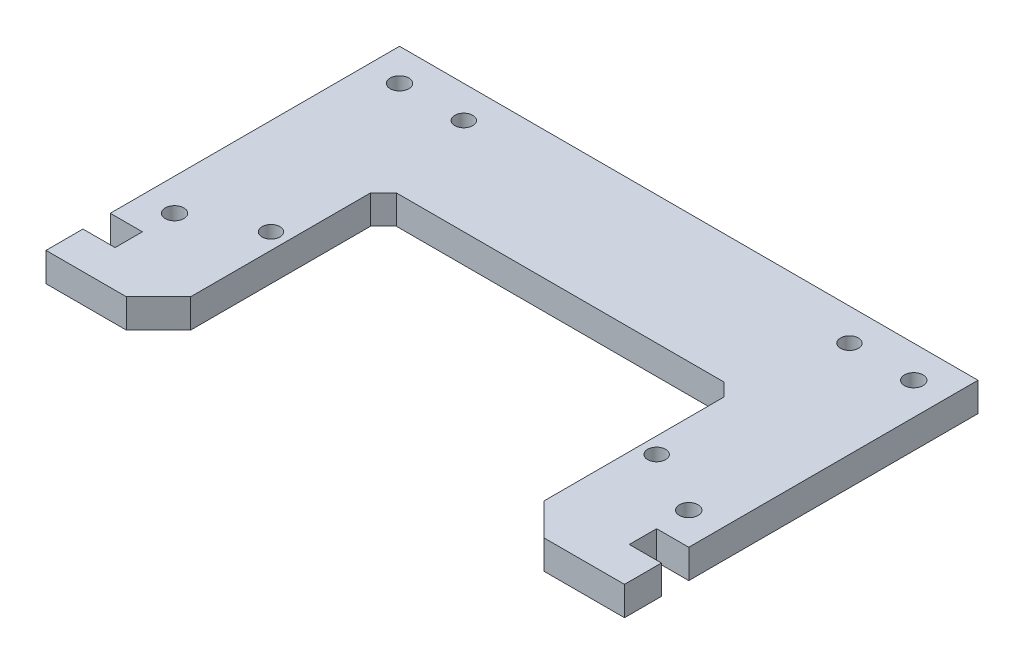
ISO-10303-21;
HEADER;
FILE_DESCRIPTION(('STEP AP214'),'2;1');
FILE_NAME('part.step','',(''),(''),'','','');
FILE_SCHEMA(('AUTOMOTIVE_DESIGN { 1 0 10303 214 1 1 1 1 }'));
ENDSEC;
DATA;
#1=APPLICATION_CONTEXT('core data for automotive mechanical design processes');
#2=APPLICATION_PROTOCOL_DEFINITION('international standard','automotive_design',2000,#1);
#3=PRODUCT_CONTEXT('',#1,'mechanical');
#4=PRODUCT('Part','Part','',(#3));
#5=PRODUCT_RELATED_PRODUCT_CATEGORY('part','',(#4));
#6=PRODUCT_DEFINITION_FORMATION('','',#4);
#7=PRODUCT_DEFINITION_CONTEXT('part definition',#1,'design');
#8=PRODUCT_DEFINITION('design','',#6,#7);
#9=PRODUCT_DEFINITION_SHAPE('','',#8);
#10=(LENGTH_UNIT() NAMED_UNIT(*) SI_UNIT(.MILLI.,.METRE.));
#11=(NAMED_UNIT(*) PLANE_ANGLE_UNIT() SI_UNIT($,.RADIAN.));
#12=(NAMED_UNIT(*) SI_UNIT($,.STERADIAN.) SOLID_ANGLE_UNIT());
#13=UNCERTAINTY_MEASURE_WITH_UNIT(LENGTH_MEASURE(1.E-05),#10,'distance_accuracy_value','');
#14=(GEOMETRIC_REPRESENTATION_CONTEXT(3) GLOBAL_UNCERTAINTY_ASSIGNED_CONTEXT((#13)) GLOBAL_UNIT_ASSIGNED_CONTEXT((#10,
#11,#12)) REPRESENTATION_CONTEXT('',''));
#15=CARTESIAN_POINT('',(0.,0.,0.));
#16=DIRECTION('',(0.,0.,1.));
#17=DIRECTION('',(1.,0.,0.));
#18=AXIS2_PLACEMENT_3D('',#15,#16,#17);
#19=CARTESIAN_POINT('',(-45.,4.5,55.));
#20=DIRECTION('',(0.,1.,0.));
#21=DIRECTION('',(0.,0.,1.));
#22=AXIS2_PLACEMENT_3D('',#19,#20,#21);
#23=PLANE('',#22);
#24=CARTESIAN_POINT('',(30.,4.5,35.));
#25=DIRECTION('',(0.,-1.,0.));
#26=DIRECTION('',(0.,0.,1.));
#27=AXIS2_PLACEMENT_3D('',#24,#25,#26);
#28=CIRCLE('',#27,1.4);
#29=CARTESIAN_POINT('',(30.,4.5,36.4));
#30=VERTEX_POINT('',#29);
#31=EDGE_CURVE('E511',#30,#30,#28,.T.);
#32=ORIENTED_EDGE('',*,*,#31,.T.);
#33=EDGE_LOOP('',(#32));
#34=FACE_BOUND('',#33,.T.);
#35=CARTESIAN_POINT('',(-30.,4.5,5.));
#36=DIRECTION('',(0.,1.,0.));
#37=DIRECTION('',(0.,0.,1.));
#38=AXIS2_PLACEMENT_3D('',#35,#36,#37);
#39=CIRCLE('',#38,1.4);
#40=CARTESIAN_POINT('',(-30.,4.5,6.4));
#41=VERTEX_POINT('',#40);
#42=EDGE_CURVE('E520',#41,#41,#39,.T.);
#43=ORIENTED_EDGE('',*,*,#42,.F.);
#44=EDGE_LOOP('',(#43));
#45=FACE_BOUND('',#44,.T.);
#46=CARTESIAN_POINT('',(-30.,4.5,35.));
#47=DIRECTION('',(0.,1.,0.));
#48=DIRECTION('',(0.,0.,1.));
#49=AXIS2_PLACEMENT_3D('',#46,#47,#48);
#50=CIRCLE('',#49,1.4);
#51=CARTESIAN_POINT('',(-30.,4.5,36.4));
#52=VERTEX_POINT('',#51);
#53=EDGE_CURVE('E198',#52,#52,#50,.T.);
#54=ORIENTED_EDGE('',*,*,#53,.F.);
#55=EDGE_LOOP('',(#54));
#56=FACE_BOUND('',#55,.T.);
#57=DIRECTION('',(0.,0.,-1.));
#58=VECTOR('',#57,1.);
#59=CARTESIAN_POINT('',(27.5,4.5,55.));
#60=LINE('',#59,#58);
#61=CARTESIAN_POINT('',(27.5,4.5,50.));
#62=VERTEX_POINT('',#61);
#63=CARTESIAN_POINT('',(27.5,4.5,22.));
#64=VERTEX_POINT('',#63);
#65=EDGE_CURVE('E231',#62,#64,#60,.T.);
#66=ORIENTED_EDGE('',*,*,#65,.F.);
#67=DIRECTION('',(-0.707106781186549,0.,-0.707106781186546));
#68=VECTOR('',#67,1.);
#69=CARTESIAN_POINT('',(-6.25000000000018,4.5,16.25));
#70=LINE('',#69,#68);
#71=CARTESIAN_POINT('',(32.5,4.5,55.));
#72=VERTEX_POINT('',#71);
#73=EDGE_CURVE('E320',#62,#72,#70,.F.);
#74=ORIENTED_EDGE('',*,*,#73,.T.);
#75=DIRECTION('',(1.,0.,0.));
#76=VECTOR('',#75,1.);
#77=CARTESIAN_POINT('',(-45.,4.5,55.));
#78=LINE('',#77,#76);
#79=CARTESIAN_POINT('',(45.,4.5,55.));
#80=VERTEX_POINT('',#79);
#81=EDGE_CURVE('E279',#72,#80,#78,.T.);
#82=ORIENTED_EDGE('',*,*,#81,.T.);
#83=DIRECTION('',(0.,0.,-1.));
#84=VECTOR('',#83,1.);
#85=CARTESIAN_POINT('',(45.,4.5,0.));
#86=LINE('',#85,#84);
#87=CARTESIAN_POINT('',(45.,4.5,49.25));
#88=VERTEX_POINT('',#87);
#89=EDGE_CURVE('E285',#80,#88,#86,.T.);
#90=ORIENTED_EDGE('',*,*,#89,.T.);
#91=DIRECTION('',(1.,0.,0.));
#92=VECTOR('',#91,1.);
#93=CARTESIAN_POINT('',(45.,4.5,49.25));
#94=LINE('',#93,#92);
#95=CARTESIAN_POINT('',(40.,4.5,49.25));
#96=VERTEX_POINT('',#95);
#97=EDGE_CURVE('E193',#96,#88,#94,.T.);
#98=ORIENTED_EDGE('',*,*,#97,.F.);
#99=DIRECTION('',(0.,0.,1.));
#100=VECTOR('',#99,1.);
#101=CARTESIAN_POINT('',(40.,4.5,45.));
#102=LINE('',#101,#100);
#103=CARTESIAN_POINT('',(40.,4.5,45.));
#104=VERTEX_POINT('',#103);
#105=EDGE_CURVE('E195',#104,#96,#102,.T.);
#106=ORIENTED_EDGE('',*,*,#105,.F.);
#107=DIRECTION('',(-1.,0.,0.));
#108=VECTOR('',#107,1.);
#109=CARTESIAN_POINT('',(45.,4.5,45.));
#110=LINE('',#109,#108);
#111=CARTESIAN_POINT('',(45.,4.5,45.));
#112=VERTEX_POINT('',#111);
#113=EDGE_CURVE('E173',#112,#104,#110,.T.);
#114=ORIENTED_EDGE('',*,*,#113,.F.);
#115=CARTESIAN_POINT('',(45.,4.5,0.));
#116=VERTEX_POINT('',#115);
#117=EDGE_CURVE('E284',#112,#116,#86,.T.);
#118=ORIENTED_EDGE('',*,*,#117,.T.);
#119=DIRECTION('',(-1.,0.,0.));
#120=VECTOR('',#119,1.);
#121=CARTESIAN_POINT('',(-45.,4.5,0.));
#122=LINE('',#121,#120);
#123=CARTESIAN_POINT('',(-45.,4.5,0.));
#124=VERTEX_POINT('',#123);
#125=EDGE_CURVE('E288',#116,#124,#122,.T.);
#126=ORIENTED_EDGE('',*,*,#125,.T.);
#127=DIRECTION('',(0.,0.,1.));
#128=VECTOR('',#127,1.);
#129=CARTESIAN_POINT('',(-45.,4.5,0.));
#130=LINE('',#129,#128);
#131=CARTESIAN_POINT('',(-45.,4.5,45.));
#132=VERTEX_POINT('',#131);
#133=EDGE_CURVE('E276',#124,#132,#130,.T.);
#134=ORIENTED_EDGE('',*,*,#133,.T.);
#135=DIRECTION('',(-1.,0.,0.));
#136=VECTOR('',#135,1.);
#137=CARTESIAN_POINT('',(-45.,4.5,45.));
#138=LINE('',#137,#136);
#139=CARTESIAN_POINT('',(-40.,4.5,45.));
#140=VERTEX_POINT('',#139);
#141=EDGE_CURVE('E215',#140,#132,#138,.T.);
#142=ORIENTED_EDGE('',*,*,#141,.F.);
#143=DIRECTION('',(0.,0.,-1.));
#144=VECTOR('',#143,1.);
#145=CARTESIAN_POINT('',(-40.,4.5,49.25));
#146=LINE('',#145,#144);
#147=CARTESIAN_POINT('',(-40.,4.5,49.25));
#148=VERTEX_POINT('',#147);
#149=EDGE_CURVE('E224',#148,#140,#146,.T.);
#150=ORIENTED_EDGE('',*,*,#149,.F.);
#151=DIRECTION('',(1.,0.,0.));
#152=VECTOR('',#151,1.);
#153=CARTESIAN_POINT('',(-45.,4.5,49.25));
#154=LINE('',#153,#152);
#155=CARTESIAN_POINT('',(-45.,4.5,49.25));
#156=VERTEX_POINT('',#155);
#157=EDGE_CURVE('E208',#156,#148,#154,.T.);
#158=ORIENTED_EDGE('',*,*,#157,.F.);
#159=CARTESIAN_POINT('',(-45.,4.5,55.));
#160=VERTEX_POINT('',#159);
#161=EDGE_CURVE('E280',#156,#160,#130,.T.);
#162=ORIENTED_EDGE('',*,*,#161,.T.);
#163=CARTESIAN_POINT('',(-32.5,4.5,55.));
#164=VERTEX_POINT('',#163);
#165=EDGE_CURVE('E281',#160,#164,#78,.T.);
#166=ORIENTED_EDGE('',*,*,#165,.T.);
#167=DIRECTION('',(-0.707106781186546,0.,0.707106781186549));
#168=VECTOR('',#167,1.);
#169=CARTESIAN_POINT('',(-38.75,4.5,61.25));
#170=LINE('',#169,#168);
#171=CARTESIAN_POINT('',(-27.5,4.5,50.));
#172=VERTEX_POINT('',#171);
#173=EDGE_CURVE('E317',#164,#172,#170,.F.);
#174=ORIENTED_EDGE('',*,*,#173,.T.);
#175=DIRECTION('',(0.,0.,1.));
#176=VECTOR('',#175,1.);
#177=CARTESIAN_POINT('',(-27.5,4.5,55.));
#178=LINE('',#177,#176);
#179=CARTESIAN_POINT('',(-27.5,4.5,22.));
#180=VERTEX_POINT('',#179);
#181=EDGE_CURVE('E241',#180,#172,#178,.T.);
#182=ORIENTED_EDGE('',*,*,#181,.F.);
#183=DIRECTION('',(-0.707106781186545,0.,0.70710678118655));
#184=VECTOR('',#183,1.);
#185=CARTESIAN_POINT('',(-27.5,4.5,22.));
#186=LINE('',#185,#184);
#187=CARTESIAN_POINT('',(-25.5,4.5,20.));
#188=VERTEX_POINT('',#187);
#189=EDGE_CURVE('E39',#180,#188,#186,.F.);
#190=ORIENTED_EDGE('',*,*,#189,.T.);
#191=DIRECTION('',(-1.,0.,0.));
#192=VECTOR('',#191,1.);
#193=CARTESIAN_POINT('',(27.5,4.5,20.));
#194=LINE('',#193,#192);
#195=CARTESIAN_POINT('',(25.5,4.5,20.));
#196=VERTEX_POINT('',#195);
#197=EDGE_CURVE('E248',#196,#188,#194,.T.);
#198=ORIENTED_EDGE('',*,*,#197,.F.);
#199=DIRECTION('',(-0.70710678118655,0.,-0.707106781186545));
#200=VECTOR('',#199,1.);
#201=CARTESIAN_POINT('',(25.5,4.5,20.));
#202=LINE('',#201,#200);
#203=EDGE_CURVE('E343',#196,#64,#202,.F.);
#204=ORIENTED_EDGE('',*,*,#203,.T.);
#205=EDGE_LOOP('',(#66,#74,#82,#90,#98,#106,#114,#118,#126,#134,#142,#150,#158,#162,#166,#174,
#182,#190,#198,#204));
#206=FACE_BOUND('',#205,.T.);
#207=CARTESIAN_POINT('',(40.,4.5,40.));
#208=DIRECTION('',(0.,1.,0.));
#209=DIRECTION('',(0.,0.,1.));
#210=AXIS2_PLACEMENT_3D('',#207,#208,#209);
#211=CIRCLE('',#210,1.45);
#212=CARTESIAN_POINT('',(40.,4.5,41.45));
#213=VERTEX_POINT('',#212);
#214=EDGE_CURVE('E258',#213,#213,#211,.T.);
#215=ORIENTED_EDGE('',*,*,#214,.F.);
#216=EDGE_LOOP('',(#215));
#217=FACE_BOUND('',#216,.T.);
#218=CARTESIAN_POINT('',(-40.,4.5,40.));
#219=DIRECTION('',(0.,1.,0.));
#220=DIRECTION('',(0.,0.,1.));
#221=AXIS2_PLACEMENT_3D('',#218,#219,#220);
#222=CIRCLE('',#221,1.45);
#223=CARTESIAN_POINT('',(-40.,4.5,41.45));
#224=VERTEX_POINT('',#223);
#225=EDGE_CURVE('E270',#224,#224,#222,.T.);
#226=ORIENTED_EDGE('',*,*,#225,.F.);
#227=EDGE_LOOP('',(#226));
#228=FACE_BOUND('',#227,.T.);
#229=CARTESIAN_POINT('',(-40.,4.5,5.));
#230=DIRECTION('',(0.,1.,0.));
#231=DIRECTION('',(0.,0.,1.));
#232=AXIS2_PLACEMENT_3D('',#229,#230,#231);
#233=CIRCLE('',#232,1.45);
#234=CARTESIAN_POINT('',(-40.,4.5,6.45));
#235=VERTEX_POINT('',#234);
#236=EDGE_CURVE('E264',#235,#235,#233,.T.);
#237=ORIENTED_EDGE('',*,*,#236,.F.);
#238=EDGE_LOOP('',(#237));
#239=FACE_BOUND('',#238,.T.);
#240=CARTESIAN_POINT('',(40.,4.5,5.));
#241=DIRECTION('',(0.,1.,0.));
#242=DIRECTION('',(0.,0.,1.));
#243=AXIS2_PLACEMENT_3D('',#240,#241,#242);
#244=CIRCLE('',#243,1.45);
#245=CARTESIAN_POINT('',(40.,4.5,6.45));
#246=VERTEX_POINT('',#245);
#247=EDGE_CURVE('E252',#246,#246,#244,.T.);
#248=ORIENTED_EDGE('',*,*,#247,.F.);
#249=EDGE_LOOP('',(#248));
#250=FACE_BOUND('',#249,.T.);
#251=CARTESIAN_POINT('',(30.,4.5,5.));
#252=DIRECTION('',(0.,-1.,0.));
#253=DIRECTION('',(0.,0.,1.));
#254=AXIS2_PLACEMENT_3D('',#251,#252,#253);
#255=CIRCLE('',#254,1.4);
#256=CARTESIAN_POINT('',(30.,4.5,6.4));
#257=VERTEX_POINT('',#256);
#258=EDGE_CURVE('E512',#257,#257,#255,.T.);
#259=ORIENTED_EDGE('',*,*,#258,.T.);
#260=EDGE_LOOP('',(#259));
#261=FACE_BOUND('',#260,.T.);
#262=ADVANCED_FACE('F31',(#34,#45,#56,#206,#217,#228,#239,#250,#261),#23,.T.);
#263=CARTESIAN_POINT('',(-45.,0.,55.));
#264=DIRECTION('',(0.,1.,0.));
#265=DIRECTION('',(0.,0.,1.));
#266=AXIS2_PLACEMENT_3D('',#263,#264,#265);
#267=PLANE('',#266);
#268=CARTESIAN_POINT('',(30.,0.,35.));
#269=DIRECTION('',(0.,-1.,0.));
#270=DIRECTION('',(0.,0.,1.));
#271=AXIS2_PLACEMENT_3D('',#268,#269,#270);
#272=CIRCLE('',#271,1.4);
#273=CARTESIAN_POINT('',(30.,0.,36.4));
#274=VERTEX_POINT('',#273);
#275=EDGE_CURVE('E514',#274,#274,#272,.T.);
#276=ORIENTED_EDGE('',*,*,#275,.F.);
#277=EDGE_LOOP('',(#276));
#278=FACE_BOUND('',#277,.T.);
#279=CARTESIAN_POINT('',(-30.,0.,5.));
#280=DIRECTION('',(0.,1.,0.));
#281=DIRECTION('',(0.,0.,1.));
#282=AXIS2_PLACEMENT_3D('',#279,#280,#281);
#283=CIRCLE('',#282,1.4);
#284=CARTESIAN_POINT('',(-30.,0.,6.4));
#285=VERTEX_POINT('',#284);
#286=EDGE_CURVE('E522',#285,#285,#283,.T.);
#287=ORIENTED_EDGE('',*,*,#286,.T.);
#288=EDGE_LOOP('',(#287));
#289=FACE_BOUND('',#288,.T.);
#290=CARTESIAN_POINT('',(-30.,0.,35.));
#291=DIRECTION('',(0.,1.,0.));
#292=DIRECTION('',(0.,0.,1.));
#293=AXIS2_PLACEMENT_3D('',#290,#291,#292);
#294=CIRCLE('',#293,1.4);
#295=CARTESIAN_POINT('',(-30.,0.,36.4));
#296=VERTEX_POINT('',#295);
#297=EDGE_CURVE('E203',#296,#296,#294,.T.);
#298=ORIENTED_EDGE('',*,*,#297,.T.);
#299=EDGE_LOOP('',(#298));
#300=FACE_BOUND('',#299,.T.);
#301=DIRECTION('',(1.,0.,0.));
#302=VECTOR('',#301,1.);
#303=CARTESIAN_POINT('',(-45.,0.,55.));
#304=LINE('',#303,#302);
#305=CARTESIAN_POINT('',(32.5,0.,55.));
#306=VERTEX_POINT('',#305);
#307=CARTESIAN_POINT('',(45.,0.,55.));
#308=VERTEX_POINT('',#307);
#309=EDGE_CURVE('E294',#306,#308,#304,.T.);
#310=ORIENTED_EDGE('',*,*,#309,.F.);
#311=DIRECTION('',(0.707106781186549,0.,0.707106781186546));
#312=VECTOR('',#311,1.);
#313=CARTESIAN_POINT('',(27.5,0.,50.));
#314=LINE('',#313,#312);
#315=CARTESIAN_POINT('',(27.5,0.,50.));
#316=VERTEX_POINT('',#315);
#317=EDGE_CURVE('E326',#306,#316,#314,.F.);
#318=ORIENTED_EDGE('',*,*,#317,.T.);
#319=DIRECTION('',(0.,0.,-1.));
#320=VECTOR('',#319,1.);
#321=CARTESIAN_POINT('',(27.5,0.,55.));
#322=LINE('',#321,#320);
#323=CARTESIAN_POINT('',(27.5,0.,22.));
#324=VERTEX_POINT('',#323);
#325=EDGE_CURVE('E237',#316,#324,#322,.T.);
#326=ORIENTED_EDGE('',*,*,#325,.T.);
#327=DIRECTION('',(0.70710678118655,0.,0.707106781186545));
#328=VECTOR('',#327,1.);
#329=CARTESIAN_POINT('',(7.74999999999976,0.,2.24999999999989));
#330=LINE('',#329,#328);
#331=CARTESIAN_POINT('',(25.5,0.,20.));
#332=VERTEX_POINT('',#331);
#333=EDGE_CURVE('E345',#324,#332,#330,.F.);
#334=ORIENTED_EDGE('',*,*,#333,.T.);
#335=DIRECTION('',(-1.,0.,0.));
#336=VECTOR('',#335,1.);
#337=CARTESIAN_POINT('',(27.5,0.,20.));
#338=LINE('',#337,#336);
#339=CARTESIAN_POINT('',(-25.5,0.,20.));
#340=VERTEX_POINT('',#339);
#341=EDGE_CURVE('E240',#332,#340,#338,.T.);
#342=ORIENTED_EDGE('',*,*,#341,.T.);
#343=DIRECTION('',(0.707106781186545,0.,-0.70710678118655));
#344=VECTOR('',#343,1.);
#345=CARTESIAN_POINT('',(-52.7499999999999,0.,47.2500000000001));
#346=LINE('',#345,#344);
#347=CARTESIAN_POINT('',(-27.5,0.,22.));
#348=VERTEX_POINT('',#347);
#349=EDGE_CURVE('E11',#340,#348,#346,.F.);
#350=ORIENTED_EDGE('',*,*,#349,.T.);
#351=DIRECTION('',(0.,0.,1.));
#352=VECTOR('',#351,1.);
#353=CARTESIAN_POINT('',(-27.5,0.,55.));
#354=LINE('',#353,#352);
#355=CARTESIAN_POINT('',(-27.5,0.,50.));
#356=VERTEX_POINT('',#355);
#357=EDGE_CURVE('E243',#348,#356,#354,.T.);
#358=ORIENTED_EDGE('',*,*,#357,.T.);
#359=DIRECTION('',(0.707106781186546,0.,-0.707106781186549));
#360=VECTOR('',#359,1.);
#361=CARTESIAN_POINT('',(-32.5,0.,55.));
#362=LINE('',#361,#360);
#363=CARTESIAN_POINT('',(-32.5,0.,55.));
#364=VERTEX_POINT('',#363);
#365=EDGE_CURVE('E324',#356,#364,#362,.F.);
#366=ORIENTED_EDGE('',*,*,#365,.T.);
#367=CARTESIAN_POINT('',(-45.,0.,55.));
#368=VERTEX_POINT('',#367);
#369=EDGE_CURVE('E295',#368,#364,#304,.T.);
#370=ORIENTED_EDGE('',*,*,#369,.F.);
#371=DIRECTION('',(0.,0.,1.));
#372=VECTOR('',#371,1.);
#373=CARTESIAN_POINT('',(-45.,0.,0.));
#374=LINE('',#373,#372);
#375=CARTESIAN_POINT('',(-45.,0.,49.25));
#376=VERTEX_POINT('',#375);
#377=EDGE_CURVE('E273',#376,#368,#374,.T.);
#378=ORIENTED_EDGE('',*,*,#377,.F.);
#379=DIRECTION('',(1.,0.,0.));
#380=VECTOR('',#379,1.);
#381=CARTESIAN_POINT('',(-45.,0.,49.25));
#382=LINE('',#381,#380);
#383=CARTESIAN_POINT('',(-40.,0.,49.25));
#384=VERTEX_POINT('',#383);
#385=EDGE_CURVE('E211',#376,#384,#382,.T.);
#386=ORIENTED_EDGE('',*,*,#385,.T.);
#387=DIRECTION('',(0.,0.,-1.));
#388=VECTOR('',#387,1.);
#389=CARTESIAN_POINT('',(-40.,0.,49.25));
#390=LINE('',#389,#388);
#391=CARTESIAN_POINT('',(-40.,0.,45.));
#392=VERTEX_POINT('',#391);
#393=EDGE_CURVE('E214',#384,#392,#390,.T.);
#394=ORIENTED_EDGE('',*,*,#393,.T.);
#395=DIRECTION('',(-1.,0.,0.));
#396=VECTOR('',#395,1.);
#397=CARTESIAN_POINT('',(-45.,0.,45.));
#398=LINE('',#397,#396);
#399=CARTESIAN_POINT('',(-45.,0.,45.));
#400=VERTEX_POINT('',#399);
#401=EDGE_CURVE('E218',#392,#400,#398,.T.);
#402=ORIENTED_EDGE('',*,*,#401,.T.);
#403=CARTESIAN_POINT('',(-45.,0.,0.));
#404=VERTEX_POINT('',#403);
#405=EDGE_CURVE('E291',#404,#400,#374,.T.);
#406=ORIENTED_EDGE('',*,*,#405,.F.);
#407=DIRECTION('',(-1.,0.,0.));
#408=VECTOR('',#407,1.);
#409=CARTESIAN_POINT('',(-45.,0.,0.));
#410=LINE('',#409,#408);
#411=CARTESIAN_POINT('',(45.,0.,0.));
#412=VERTEX_POINT('',#411);
#413=EDGE_CURVE('E301',#412,#404,#410,.T.);
#414=ORIENTED_EDGE('',*,*,#413,.F.);
#415=DIRECTION('',(0.,0.,-1.));
#416=VECTOR('',#415,1.);
#417=CARTESIAN_POINT('',(45.,0.,0.));
#418=LINE('',#417,#416);
#419=CARTESIAN_POINT('',(45.,0.,45.));
#420=VERTEX_POINT('',#419);
#421=EDGE_CURVE('E192',#420,#412,#418,.T.);
#422=ORIENTED_EDGE('',*,*,#421,.F.);
#423=DIRECTION('',(-1.,0.,0.));
#424=VECTOR('',#423,1.);
#425=CARTESIAN_POINT('',(45.,0.,45.));
#426=LINE('',#425,#424);
#427=CARTESIAN_POINT('',(40.,0.,45.));
#428=VERTEX_POINT('',#427);
#429=EDGE_CURVE('E170',#420,#428,#426,.T.);
#430=ORIENTED_EDGE('',*,*,#429,.T.);
#431=DIRECTION('',(0.,0.,1.));
#432=VECTOR('',#431,1.);
#433=CARTESIAN_POINT('',(40.,0.,45.));
#434=LINE('',#433,#432);
#435=CARTESIAN_POINT('',(40.,0.,49.25));
#436=VERTEX_POINT('',#435);
#437=EDGE_CURVE('E181',#428,#436,#434,.T.);
#438=ORIENTED_EDGE('',*,*,#437,.T.);
#439=DIRECTION('',(1.,0.,0.));
#440=VECTOR('',#439,1.);
#441=CARTESIAN_POINT('',(45.,0.,49.25));
#442=LINE('',#441,#440);
#443=CARTESIAN_POINT('',(45.,0.,49.25));
#444=VERTEX_POINT('',#443);
#445=EDGE_CURVE('E185',#436,#444,#442,.T.);
#446=ORIENTED_EDGE('',*,*,#445,.T.);
#447=EDGE_CURVE('E298',#308,#444,#418,.T.);
#448=ORIENTED_EDGE('',*,*,#447,.F.);
#449=EDGE_LOOP('',(#310,#318,#326,#334,#342,#350,#358,#366,#370,#378,#386,#394,#402,#406,#414,
#422,#430,#438,#446,#448));
#450=FACE_BOUND('',#449,.T.);
#451=CARTESIAN_POINT('',(40.,0.,40.));
#452=DIRECTION('',(0.,1.,0.));
#453=DIRECTION('',(0.,0.,1.));
#454=AXIS2_PLACEMENT_3D('',#451,#452,#453);
#455=CIRCLE('',#454,1.45);
#456=CARTESIAN_POINT('',(40.,0.,41.45));
#457=VERTEX_POINT('',#456);
#458=EDGE_CURVE('E255',#457,#457,#455,.T.);
#459=ORIENTED_EDGE('',*,*,#458,.T.);
#460=EDGE_LOOP('',(#459));
#461=FACE_BOUND('',#460,.T.);
#462=CARTESIAN_POINT('',(-40.,0.,40.));
#463=DIRECTION('',(0.,1.,0.));
#464=DIRECTION('',(0.,0.,1.));
#465=AXIS2_PLACEMENT_3D('',#462,#463,#464);
#466=CIRCLE('',#465,1.45);
#467=CARTESIAN_POINT('',(-40.,0.,41.45));
#468=VERTEX_POINT('',#467);
#469=EDGE_CURVE('E267',#468,#468,#466,.T.);
#470=ORIENTED_EDGE('',*,*,#469,.T.);
#471=EDGE_LOOP('',(#470));
#472=FACE_BOUND('',#471,.T.);
#473=CARTESIAN_POINT('',(-40.,0.,5.));
#474=DIRECTION('',(0.,1.,0.));
#475=DIRECTION('',(0.,0.,1.));
#476=AXIS2_PLACEMENT_3D('',#473,#474,#475);
#477=CIRCLE('',#476,1.45);
#478=CARTESIAN_POINT('',(-40.,0.,6.45));
#479=VERTEX_POINT('',#478);
#480=EDGE_CURVE('E261',#479,#479,#477,.T.);
#481=ORIENTED_EDGE('',*,*,#480,.T.);
#482=EDGE_LOOP('',(#481));
#483=FACE_BOUND('',#482,.T.);
#484=CARTESIAN_POINT('',(40.,0.,5.));
#485=DIRECTION('',(0.,1.,0.));
#486=DIRECTION('',(0.,0.,1.));
#487=AXIS2_PLACEMENT_3D('',#484,#485,#486);
#488=CIRCLE('',#487,1.45);
#489=CARTESIAN_POINT('',(40.,0.,6.45));
#490=VERTEX_POINT('',#489);
#491=EDGE_CURVE('E245',#490,#490,#488,.T.);
#492=ORIENTED_EDGE('',*,*,#491,.T.);
#493=EDGE_LOOP('',(#492));
#494=FACE_BOUND('',#493,.T.);
#495=CARTESIAN_POINT('',(30.,0.,5.));
#496=DIRECTION('',(0.,-1.,0.));
#497=DIRECTION('',(0.,0.,1.));
#498=AXIS2_PLACEMENT_3D('',#495,#496,#497);
#499=CIRCLE('',#498,1.4);
#500=CARTESIAN_POINT('',(30.,0.,6.4));
#501=VERTEX_POINT('',#500);
#502=EDGE_CURVE('E510',#501,#501,#499,.T.);
#503=ORIENTED_EDGE('',*,*,#502,.F.);
#504=EDGE_LOOP('',(#503));
#505=FACE_BOUND('',#504,.T.);
#506=ADVANCED_FACE('F189',(#278,#289,#300,#450,#461,#472,#483,#494,#505),#267,.F.);
#507=CARTESIAN_POINT('',(45.,4.5,0.));
#508=DIRECTION('',(-1.,0.,0.));
#509=DIRECTION('',(0.,0.,1.));
#510=AXIS2_PLACEMENT_3D('',#507,#508,#509);
#511=PLANE('',#510);
#512=ORIENTED_EDGE('',*,*,#447,.T.);
#513=DIRECTION('',(0.,1.,0.));
#514=VECTOR('',#513,1.);
#515=CARTESIAN_POINT('',(45.,0.,49.25));
#516=LINE('',#515,#514);
#517=EDGE_CURVE('E205',#444,#88,#516,.T.);
#518=ORIENTED_EDGE('',*,*,#517,.T.);
#519=ORIENTED_EDGE('',*,*,#89,.F.);
#520=DIRECTION('',(0.,-1.,0.));
#521=VECTOR('',#520,1.);
#522=CARTESIAN_POINT('',(45.,4.5,55.));
#523=LINE('',#522,#521);
#524=EDGE_CURVE('E308',#80,#308,#523,.T.);
#525=ORIENTED_EDGE('',*,*,#524,.T.);
#526=EDGE_LOOP('',(#512,#518,#519,#525));
#527=FACE_BOUND('',#526,.T.);
#528=ADVANCED_FACE('F400',(#527),#511,.F.);
#529=CARTESIAN_POINT('',(-45.,4.5,0.));
#530=DIRECTION('',(1.,0.,0.));
#531=DIRECTION('',(0.,0.,-1.));
#532=AXIS2_PLACEMENT_3D('',#529,#530,#531);
#533=PLANE('',#532);
#534=ORIENTED_EDGE('',*,*,#405,.T.);
#535=DIRECTION('',(0.,1.,0.));
#536=VECTOR('',#535,1.);
#537=CARTESIAN_POINT('',(-45.,0.,45.));
#538=LINE('',#537,#536);
#539=EDGE_CURVE('E228',#400,#132,#538,.T.);
#540=ORIENTED_EDGE('',*,*,#539,.T.);
#541=ORIENTED_EDGE('',*,*,#133,.F.);
#542=DIRECTION('',(0.,-1.,0.));
#543=VECTOR('',#542,1.);
#544=CARTESIAN_POINT('',(-45.,4.5,0.));
#545=LINE('',#544,#543);
#546=EDGE_CURVE('E290',#124,#404,#545,.T.);
#547=ORIENTED_EDGE('',*,*,#546,.T.);
#548=EDGE_LOOP('',(#534,#540,#541,#547));
#549=FACE_BOUND('',#548,.T.);
#550=ADVANCED_FACE('F385',(#549),#533,.F.);
#551=CARTESIAN_POINT('',(-45.,4.5,55.));
#552=DIRECTION('',(0.,0.,-1.));
#553=DIRECTION('',(-1.,0.,0.));
#554=AXIS2_PLACEMENT_3D('',#551,#552,#553);
#555=PLANE('',#554);
#556=ORIENTED_EDGE('',*,*,#81,.F.);
#557=DIRECTION('',(0.,-1.,0.));
#558=VECTOR('',#557,1.);
#559=CARTESIAN_POINT('',(32.5,4.5,55.));
#560=LINE('',#559,#558);
#561=EDGE_CURVE('E322',#72,#306,#560,.T.);
#562=ORIENTED_EDGE('',*,*,#561,.T.);
#563=ORIENTED_EDGE('',*,*,#309,.T.);
#564=ORIENTED_EDGE('',*,*,#524,.F.);
#565=EDGE_LOOP('',(#556,#562,#563,#564));
#566=FACE_BOUND('',#565,.T.);
#567=ADVANCED_FACE('F443',(#566),#555,.F.);
#568=ORIENTED_EDGE('',*,*,#161,.F.);
#569=DIRECTION('',(0.,1.,0.));
#570=VECTOR('',#569,1.);
#571=CARTESIAN_POINT('',(-45.,0.,49.25));
#572=LINE('',#571,#570);
#573=EDGE_CURVE('E221',#376,#156,#572,.T.);
#574=ORIENTED_EDGE('',*,*,#573,.F.);
#575=ORIENTED_EDGE('',*,*,#377,.T.);
#576=DIRECTION('',(0.,-1.,0.));
#577=VECTOR('',#576,1.);
#578=CARTESIAN_POINT('',(-45.,4.5,55.));
#579=LINE('',#578,#577);
#580=EDGE_CURVE('E311',#160,#368,#579,.T.);
#581=ORIENTED_EDGE('',*,*,#580,.F.);
#582=EDGE_LOOP('',(#568,#574,#575,#581));
#583=FACE_BOUND('',#582,.T.);
#584=ADVANCED_FACE('F371',(#583),#533,.F.);
#585=ORIENTED_EDGE('',*,*,#369,.T.);
#586=DIRECTION('',(0.,1.,0.));
#587=VECTOR('',#586,1.);
#588=CARTESIAN_POINT('',(-32.5,4.5,55.));
#589=LINE('',#588,#587);
#590=EDGE_CURVE('E328',#364,#164,#589,.T.);
#591=ORIENTED_EDGE('',*,*,#590,.T.);
#592=ORIENTED_EDGE('',*,*,#165,.F.);
#593=ORIENTED_EDGE('',*,*,#580,.T.);
#594=EDGE_LOOP('',(#585,#591,#592,#593));
#595=FACE_BOUND('',#594,.T.);
#596=ADVANCED_FACE('F364',(#595),#555,.F.);
#597=ORIENTED_EDGE('',*,*,#117,.F.);
#598=DIRECTION('',(0.,1.,0.));
#599=VECTOR('',#598,1.);
#600=CARTESIAN_POINT('',(45.,0.,45.));
#601=LINE('',#600,#599);
#602=EDGE_CURVE('E178',#420,#112,#601,.T.);
#603=ORIENTED_EDGE('',*,*,#602,.F.);
#604=ORIENTED_EDGE('',*,*,#421,.T.);
#605=DIRECTION('',(0.,-1.,0.));
#606=VECTOR('',#605,1.);
#607=CARTESIAN_POINT('',(45.,4.5,0.));
#608=LINE('',#607,#606);
#609=EDGE_CURVE('E305',#116,#412,#608,.T.);
#610=ORIENTED_EDGE('',*,*,#609,.F.);
#611=EDGE_LOOP('',(#597,#603,#604,#610));
#612=FACE_BOUND('',#611,.T.);
#613=ADVANCED_FACE('F394',(#612),#511,.F.);
#614=CARTESIAN_POINT('',(-45.,4.5,0.));
#615=DIRECTION('',(0.,0.,1.));
#616=DIRECTION('',(1.,0.,0.));
#617=AXIS2_PLACEMENT_3D('',#614,#615,#616);
#618=PLANE('',#617);
#619=ORIENTED_EDGE('',*,*,#413,.T.);
#620=ORIENTED_EDGE('',*,*,#546,.F.);
#621=ORIENTED_EDGE('',*,*,#125,.F.);
#622=ORIENTED_EDGE('',*,*,#609,.T.);
#623=EDGE_LOOP('',(#619,#620,#621,#622));
#624=FACE_BOUND('',#623,.T.);
#625=ADVANCED_FACE('F390',(#624),#618,.F.);
#626=CARTESIAN_POINT('',(-40.,4.5,40.));
#627=DIRECTION('',(0.,-1.,0.));
#628=DIRECTION('',(0.,0.,-1.));
#629=AXIS2_PLACEMENT_3D('',#626,#627,#628);
#630=CYLINDRICAL_SURFACE('',#629,1.45);
#631=ORIENTED_EDGE('',*,*,#225,.T.);
#632=EDGE_LOOP('',(#631));
#633=FACE_BOUND('',#632,.T.);
#634=ORIENTED_EDGE('',*,*,#469,.F.);
#635=EDGE_LOOP('',(#634));
#636=FACE_BOUND('',#635,.T.);
#637=ADVANCED_FACE('F434',(#633,#636),#630,.F.);
#638=CARTESIAN_POINT('',(-40.,4.5,5.));
#639=DIRECTION('',(0.,-1.,0.));
#640=DIRECTION('',(0.,0.,-1.));
#641=AXIS2_PLACEMENT_3D('',#638,#639,#640);
#642=CYLINDRICAL_SURFACE('',#641,1.45);
#643=ORIENTED_EDGE('',*,*,#236,.T.);
#644=EDGE_LOOP('',(#643));
#645=FACE_BOUND('',#644,.T.);
#646=ORIENTED_EDGE('',*,*,#480,.F.);
#647=EDGE_LOOP('',(#646));
#648=FACE_BOUND('',#647,.T.);
#649=ADVANCED_FACE('F494',(#645,#648),#642,.F.);
#650=CARTESIAN_POINT('',(40.,4.5,40.));
#651=DIRECTION('',(0.,-1.,0.));
#652=DIRECTION('',(0.,0.,-1.));
#653=AXIS2_PLACEMENT_3D('',#650,#651,#652);
#654=CYLINDRICAL_SURFACE('',#653,1.45);
#655=ORIENTED_EDGE('',*,*,#214,.T.);
#656=EDGE_LOOP('',(#655));
#657=FACE_BOUND('',#656,.T.);
#658=ORIENTED_EDGE('',*,*,#458,.F.);
#659=EDGE_LOOP('',(#658));
#660=FACE_BOUND('',#659,.T.);
#661=ADVANCED_FACE('F491',(#657,#660),#654,.F.);
#662=CARTESIAN_POINT('',(40.,4.5,5.));
#663=DIRECTION('',(0.,-1.,0.));
#664=DIRECTION('',(0.,0.,-1.));
#665=AXIS2_PLACEMENT_3D('',#662,#663,#664);
#666=CYLINDRICAL_SURFACE('',#665,1.45);
#667=ORIENTED_EDGE('',*,*,#247,.T.);
#668=EDGE_LOOP('',(#667));
#669=FACE_BOUND('',#668,.T.);
#670=ORIENTED_EDGE('',*,*,#491,.F.);
#671=EDGE_LOOP('',(#670));
#672=FACE_BOUND('',#671,.T.);
#673=ADVANCED_FACE('F488',(#669,#672),#666,.F.);
#674=CARTESIAN_POINT('',(27.5,0.,55.));
#675=DIRECTION('',(1.,0.,0.));
#676=DIRECTION('',(0.,0.,-1.));
#677=AXIS2_PLACEMENT_3D('',#674,#675,#676);
#678=PLANE('',#677);
#679=ORIENTED_EDGE('',*,*,#65,.T.);
#680=DIRECTION('',(0.,-1.,0.));
#681=VECTOR('',#680,1.);
#682=CARTESIAN_POINT('',(27.5,0.,22.));
#683=LINE('',#682,#681);
#684=EDGE_CURVE('E339',#64,#324,#683,.T.);
#685=ORIENTED_EDGE('',*,*,#684,.T.);
#686=ORIENTED_EDGE('',*,*,#325,.F.);
#687=DIRECTION('',(0.,1.,0.));
#688=VECTOR('',#687,1.);
#689=CARTESIAN_POINT('',(27.5,0.,50.));
#690=LINE('',#689,#688);
#691=EDGE_CURVE('E314',#316,#62,#690,.T.);
#692=ORIENTED_EDGE('',*,*,#691,.T.);
#693=EDGE_LOOP('',(#679,#685,#686,#692));
#694=FACE_BOUND('',#693,.T.);
#695=ADVANCED_FACE('F411',(#694),#678,.F.);
#696=CARTESIAN_POINT('',(-27.5,0.,55.));
#697=DIRECTION('',(-1.,0.,0.));
#698=DIRECTION('',(0.,0.,1.));
#699=AXIS2_PLACEMENT_3D('',#696,#697,#698);
#700=PLANE('',#699);
#701=ORIENTED_EDGE('',*,*,#357,.F.);
#702=DIRECTION('',(0.,1.,0.));
#703=VECTOR('',#702,1.);
#704=CARTESIAN_POINT('',(-27.5,4.5,22.));
#705=LINE('',#704,#703);
#706=EDGE_CURVE('E341',#348,#180,#705,.T.);
#707=ORIENTED_EDGE('',*,*,#706,.T.);
#708=ORIENTED_EDGE('',*,*,#181,.T.);
#709=DIRECTION('',(0.,-1.,0.));
#710=VECTOR('',#709,1.);
#711=CARTESIAN_POINT('',(-27.5,0.,50.));
#712=LINE('',#711,#710);
#713=EDGE_CURVE('E331',#172,#356,#712,.T.);
#714=ORIENTED_EDGE('',*,*,#713,.T.);
#715=EDGE_LOOP('',(#701,#707,#708,#714));
#716=FACE_BOUND('',#715,.T.);
#717=ADVANCED_FACE('F356',(#716),#700,.F.);
#718=CARTESIAN_POINT('',(27.5,0.,20.));
#719=DIRECTION('',(0.,0.,-1.));
#720=DIRECTION('',(-1.,0.,0.));
#721=AXIS2_PLACEMENT_3D('',#718,#719,#720);
#722=PLANE('',#721);
#723=ORIENTED_EDGE('',*,*,#341,.F.);
#724=DIRECTION('',(0.,1.,0.));
#725=VECTOR('',#724,1.);
#726=CARTESIAN_POINT('',(25.5,4.5,20.));
#727=LINE('',#726,#725);
#728=EDGE_CURVE('E336',#332,#196,#727,.T.);
#729=ORIENTED_EDGE('',*,*,#728,.T.);
#730=ORIENTED_EDGE('',*,*,#197,.T.);
#731=DIRECTION('',(0.,-1.,0.));
#732=VECTOR('',#731,1.);
#733=CARTESIAN_POINT('',(-25.5,0.,20.));
#734=LINE('',#733,#732);
#735=EDGE_CURVE('E334',#188,#340,#734,.T.);
#736=ORIENTED_EDGE('',*,*,#735,.T.);
#737=EDGE_LOOP('',(#723,#729,#730,#736));
#738=FACE_BOUND('',#737,.T.);
#739=ADVANCED_FACE('F353',(#738),#722,.F.);
#740=CARTESIAN_POINT('',(-45.,0.,45.));
#741=DIRECTION('',(0.,0.,-1.));
#742=DIRECTION('',(-1.,0.,0.));
#743=AXIS2_PLACEMENT_3D('',#740,#741,#742);
#744=PLANE('',#743);
#745=ORIENTED_EDGE('',*,*,#141,.T.);
#746=ORIENTED_EDGE('',*,*,#539,.F.);
#747=ORIENTED_EDGE('',*,*,#401,.F.);
#748=DIRECTION('',(0.,1.,0.));
#749=VECTOR('',#748,1.);
#750=CARTESIAN_POINT('',(-40.,0.,45.));
#751=LINE('',#750,#749);
#752=EDGE_CURVE('E232',#392,#140,#751,.T.);
#753=ORIENTED_EDGE('',*,*,#752,.T.);
#754=EDGE_LOOP('',(#745,#746,#747,#753));
#755=FACE_BOUND('',#754,.T.);
#756=ADVANCED_FACE('F382',(#755),#744,.F.);
#757=CARTESIAN_POINT('',(-40.,0.,49.25));
#758=DIRECTION('',(1.,0.,0.));
#759=DIRECTION('',(0.,0.,-1.));
#760=AXIS2_PLACEMENT_3D('',#757,#758,#759);
#761=PLANE('',#760);
#762=ORIENTED_EDGE('',*,*,#149,.T.);
#763=ORIENTED_EDGE('',*,*,#752,.F.);
#764=ORIENTED_EDGE('',*,*,#393,.F.);
#765=DIRECTION('',(0.,1.,0.));
#766=VECTOR('',#765,1.);
#767=CARTESIAN_POINT('',(-40.,0.,49.25));
#768=LINE('',#767,#766);
#769=EDGE_CURVE('E234',#384,#148,#768,.T.);
#770=ORIENTED_EDGE('',*,*,#769,.T.);
#771=EDGE_LOOP('',(#762,#763,#764,#770));
#772=FACE_BOUND('',#771,.T.);
#773=ADVANCED_FACE('F378',(#772),#761,.F.);
#774=CARTESIAN_POINT('',(-45.,0.,49.25));
#775=DIRECTION('',(0.,0.,1.));
#776=DIRECTION('',(1.,0.,0.));
#777=AXIS2_PLACEMENT_3D('',#774,#775,#776);
#778=PLANE('',#777);
#779=ORIENTED_EDGE('',*,*,#157,.T.);
#780=ORIENTED_EDGE('',*,*,#769,.F.);
#781=ORIENTED_EDGE('',*,*,#385,.F.);
#782=ORIENTED_EDGE('',*,*,#573,.T.);
#783=EDGE_LOOP('',(#779,#780,#781,#782));
#784=FACE_BOUND('',#783,.T.);
#785=ADVANCED_FACE('F375',(#784),#778,.F.);
#786=CARTESIAN_POINT('',(45.,0.,49.25));
#787=DIRECTION('',(0.,0.,1.));
#788=DIRECTION('',(1.,0.,0.));
#789=AXIS2_PLACEMENT_3D('',#786,#787,#788);
#790=PLANE('',#789);
#791=ORIENTED_EDGE('',*,*,#97,.T.);
#792=ORIENTED_EDGE('',*,*,#517,.F.);
#793=ORIENTED_EDGE('',*,*,#445,.F.);
#794=DIRECTION('',(0.,1.,0.));
#795=VECTOR('',#794,1.);
#796=CARTESIAN_POINT('',(40.,0.,49.25));
#797=LINE('',#796,#795);
#798=EDGE_CURVE('E177',#436,#96,#797,.T.);
#799=ORIENTED_EDGE('',*,*,#798,.T.);
#800=EDGE_LOOP('',(#791,#792,#793,#799));
#801=FACE_BOUND('',#800,.T.);
#802=ADVANCED_FACE('F398',(#801),#790,.F.);
#803=CARTESIAN_POINT('',(40.,0.,45.));
#804=DIRECTION('',(-1.,0.,0.));
#805=DIRECTION('',(0.,0.,1.));
#806=AXIS2_PLACEMENT_3D('',#803,#804,#805);
#807=PLANE('',#806);
#808=ORIENTED_EDGE('',*,*,#105,.T.);
#809=ORIENTED_EDGE('',*,*,#798,.F.);
#810=ORIENTED_EDGE('',*,*,#437,.F.);
#811=DIRECTION('',(0.,1.,0.));
#812=VECTOR('',#811,1.);
#813=CARTESIAN_POINT('',(40.,0.,45.));
#814=LINE('',#813,#812);
#815=EDGE_CURVE('E166',#428,#104,#814,.T.);
#816=ORIENTED_EDGE('',*,*,#815,.T.);
#817=EDGE_LOOP('',(#808,#809,#810,#816));
#818=FACE_BOUND('',#817,.T.);
#819=ADVANCED_FACE('F182',(#818),#807,.F.);
#820=CARTESIAN_POINT('',(45.,0.,45.));
#821=DIRECTION('',(0.,0.,-1.));
#822=DIRECTION('',(-1.,0.,0.));
#823=AXIS2_PLACEMENT_3D('',#820,#821,#822);
#824=PLANE('',#823);
#825=ORIENTED_EDGE('',*,*,#113,.T.);
#826=ORIENTED_EDGE('',*,*,#815,.F.);
#827=ORIENTED_EDGE('',*,*,#429,.F.);
#828=ORIENTED_EDGE('',*,*,#602,.T.);
#829=EDGE_LOOP('',(#825,#826,#827,#828));
#830=FACE_BOUND('',#829,.T.);
#831=ADVANCED_FACE('F168',(#830),#824,.F.);
#832=CARTESIAN_POINT('',(-30.,0.,35.));
#833=DIRECTION('',(0.,1.,0.));
#834=DIRECTION('',(0.,0.,1.));
#835=AXIS2_PLACEMENT_3D('',#832,#833,#834);
#836=CYLINDRICAL_SURFACE('',#835,1.4);
#837=ORIENTED_EDGE('',*,*,#297,.F.);
#838=EDGE_LOOP('',(#837));
#839=FACE_BOUND('',#838,.T.);
#840=ORIENTED_EDGE('',*,*,#53,.T.);
#841=EDGE_LOOP('',(#840));
#842=FACE_BOUND('',#841,.T.);
#843=ADVANCED_FACE('F465',(#839,#842),#836,.F.);
#844=CARTESIAN_POINT('',(-30.,0.,5.));
#845=DIRECTION('',(0.,1.,0.));
#846=DIRECTION('',(0.,0.,1.));
#847=AXIS2_PLACEMENT_3D('',#844,#845,#846);
#848=CYLINDRICAL_SURFACE('',#847,1.4);
#849=ORIENTED_EDGE('',*,*,#286,.F.);
#850=EDGE_LOOP('',(#849));
#851=FACE_BOUND('',#850,.T.);
#852=ORIENTED_EDGE('',*,*,#42,.T.);
#853=EDGE_LOOP('',(#852));
#854=FACE_BOUND('',#853,.T.);
#855=ADVANCED_FACE('F457',(#851,#854),#848,.F.);
#856=CARTESIAN_POINT('',(30.,0.,35.));
#857=DIRECTION('',(0.,1.,0.));
#858=DIRECTION('',(0.,0.,1.));
#859=AXIS2_PLACEMENT_3D('',#856,#857,#858);
#860=CYLINDRICAL_SURFACE('',#859,1.4);
#861=ORIENTED_EDGE('',*,*,#275,.T.);
#862=EDGE_LOOP('',(#861));
#863=FACE_BOUND('',#862,.T.);
#864=ORIENTED_EDGE('',*,*,#31,.F.);
#865=EDGE_LOOP('',(#864));
#866=FACE_BOUND('',#865,.T.);
#867=ADVANCED_FACE('F451',(#863,#866),#860,.F.);
#868=CARTESIAN_POINT('',(30.,0.,5.));
#869=DIRECTION('',(0.,1.,0.));
#870=DIRECTION('',(0.,0.,1.));
#871=AXIS2_PLACEMENT_3D('',#868,#869,#870);
#872=CYLINDRICAL_SURFACE('',#871,1.4);
#873=ORIENTED_EDGE('',*,*,#502,.T.);
#874=EDGE_LOOP('',(#873));
#875=FACE_BOUND('',#874,.T.);
#876=ORIENTED_EDGE('',*,*,#258,.F.);
#877=EDGE_LOOP('',(#876));
#878=FACE_BOUND('',#877,.T.);
#879=ADVANCED_FACE('F447',(#875,#878),#872,.F.);
#880=CARTESIAN_POINT('',(27.5,0.,50.));
#881=DIRECTION('',(0.707106781186546,0.,-0.707106781186549));
#882=DIRECTION('',(-0.707106781186549,0.,-0.707106781186546));
#883=AXIS2_PLACEMENT_3D('',#880,#881,#882);
#884=PLANE('',#883);
#885=ORIENTED_EDGE('',*,*,#317,.F.);
#886=ORIENTED_EDGE('',*,*,#561,.F.);
#887=ORIENTED_EDGE('',*,*,#73,.F.);
#888=ORIENTED_EDGE('',*,*,#691,.F.);
#889=EDGE_LOOP('',(#885,#886,#887,#888));
#890=FACE_BOUND('',#889,.T.);
#891=ADVANCED_FACE('F409',(#890),#884,.F.);
#892=CARTESIAN_POINT('',(-32.5,4.5,55.));
#893=DIRECTION('',(-0.707106781186549,0.,-0.707106781186546));
#894=DIRECTION('',(-0.707106781186546,0.,0.707106781186549));
#895=AXIS2_PLACEMENT_3D('',#892,#893,#894);
#896=PLANE('',#895);
#897=ORIENTED_EDGE('',*,*,#365,.F.);
#898=ORIENTED_EDGE('',*,*,#713,.F.);
#899=ORIENTED_EDGE('',*,*,#173,.F.);
#900=ORIENTED_EDGE('',*,*,#590,.F.);
#901=EDGE_LOOP('',(#897,#898,#899,#900));
#902=FACE_BOUND('',#901,.T.);
#903=ADVANCED_FACE('F367',(#902),#896,.F.);
#904=CARTESIAN_POINT('',(25.5,0.,20.));
#905=DIRECTION('',(-0.707106781186545,0.,0.70710678118655));
#906=DIRECTION('',(0.70710678118655,0.,0.707106781186545));
#907=AXIS2_PLACEMENT_3D('',#904,#905,#906);
#908=PLANE('',#907);
#909=ORIENTED_EDGE('',*,*,#333,.F.);
#910=ORIENTED_EDGE('',*,*,#684,.F.);
#911=ORIENTED_EDGE('',*,*,#203,.F.);
#912=ORIENTED_EDGE('',*,*,#728,.F.);
#913=EDGE_LOOP('',(#909,#910,#911,#912));
#914=FACE_BOUND('',#913,.T.);
#915=ADVANCED_FACE('F416',(#914),#908,.T.);
#916=CARTESIAN_POINT('',(-27.5,0.,22.));
#917=DIRECTION('',(0.70710678118655,0.,0.707106781186545));
#918=DIRECTION('',(0.707106781186545,0.,-0.70710678118655));
#919=AXIS2_PLACEMENT_3D('',#916,#917,#918);
#920=PLANE('',#919);
#921=ORIENTED_EDGE('',*,*,#349,.F.);
#922=ORIENTED_EDGE('',*,*,#735,.F.);
#923=ORIENTED_EDGE('',*,*,#189,.F.);
#924=ORIENTED_EDGE('',*,*,#706,.F.);
#925=EDGE_LOOP('',(#921,#922,#923,#924));
#926=FACE_BOUND('',#925,.T.);
#927=ADVANCED_FACE('F33',(#926),#920,.T.);
#928=CLOSED_SHELL('',(#262,#506,#528,#550,#567,#584,#596,#613,#625,#637,#649,#661,#673,#695,
#717,#739,#756,#773,#785,#802,#819,#831,#843,#855,#867,#879,#891,#903,#915,#927));
#929=MANIFOLD_SOLID_BREP('B2',#928);
#930=ADVANCED_BREP_SHAPE_REPRESENTATION('',(#18,#929),#14);
#931=SHAPE_DEFINITION_REPRESENTATION(#9,#930);
ENDSEC;
END-ISO-10303-21;
